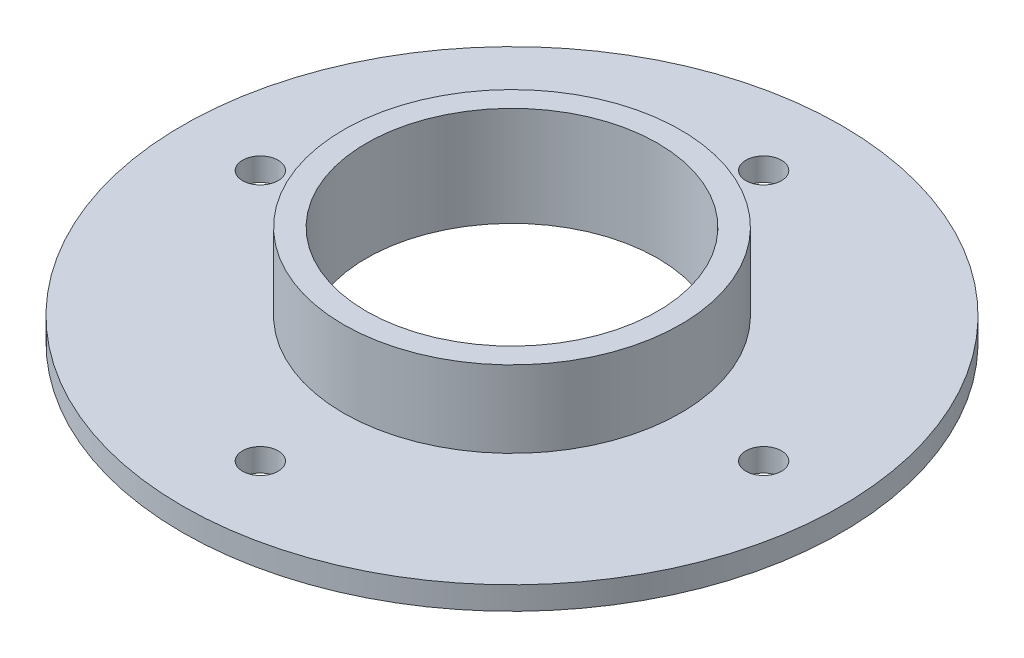
ISO-10303-21;
HEADER;
FILE_DESCRIPTION(('STEP AP214'),'2;1');
FILE_NAME('part.step','',(''),(''),'','','');
FILE_SCHEMA(('AUTOMOTIVE_DESIGN { 1 0 10303 214 1 1 1 1 }'));
ENDSEC;
DATA;
#1=APPLICATION_CONTEXT('core data for automotive mechanical design processes');
#2=APPLICATION_PROTOCOL_DEFINITION('international standard','automotive_design',2000,#1);
#3=PRODUCT_CONTEXT('',#1,'mechanical');
#4=PRODUCT('Part','Part','',(#3));
#5=PRODUCT_RELATED_PRODUCT_CATEGORY('part','',(#4));
#6=PRODUCT_DEFINITION_FORMATION('','',#4);
#7=PRODUCT_DEFINITION_CONTEXT('part definition',#1,'design');
#8=PRODUCT_DEFINITION('design','',#6,#7);
#9=PRODUCT_DEFINITION_SHAPE('','',#8);
#10=(LENGTH_UNIT() NAMED_UNIT(*) SI_UNIT(.MILLI.,.METRE.));
#11=(NAMED_UNIT(*) PLANE_ANGLE_UNIT() SI_UNIT($,.RADIAN.));
#12=(NAMED_UNIT(*) SI_UNIT($,.STERADIAN.) SOLID_ANGLE_UNIT());
#13=UNCERTAINTY_MEASURE_WITH_UNIT(LENGTH_MEASURE(1.E-05),#10,'distance_accuracy_value','');
#14=(GEOMETRIC_REPRESENTATION_CONTEXT(3) GLOBAL_UNCERTAINTY_ASSIGNED_CONTEXT((#13)) GLOBAL_UNIT_ASSIGNED_CONTEXT((#10,
#11,#12)) REPRESENTATION_CONTEXT('',''));
#15=CARTESIAN_POINT('',(0.,0.,0.));
#16=DIRECTION('',(0.,0.,1.));
#17=DIRECTION('',(1.,0.,0.));
#18=AXIS2_PLACEMENT_3D('',#15,#16,#17);
#19=CARTESIAN_POINT('',(0.,3.,0.));
#20=DIRECTION('',(0.,-1.,0.));
#21=DIRECTION('',(0.,0.,-1.));
#22=AXIS2_PLACEMENT_3D('',#19,#20,#21);
#23=CYLINDRICAL_SURFACE('',#22,43.);
#24=CARTESIAN_POINT('',(0.,3.,0.));
#25=DIRECTION('',(0.,1.,0.));
#26=DIRECTION('',(0.,0.,1.));
#27=AXIS2_PLACEMENT_3D('',#24,#25,#26);
#28=CIRCLE('',#27,43.);
#29=CARTESIAN_POINT('',(0.,3.,43.));
#30=VERTEX_POINT('',#29);
#31=EDGE_CURVE('E10',#30,#30,#28,.T.);
#32=ORIENTED_EDGE('',*,*,#31,.F.);
#33=EDGE_LOOP('',(#32));
#34=FACE_BOUND('',#33,.T.);
#35=CARTESIAN_POINT('',(0.,0.,0.));
#36=DIRECTION('',(0.,1.,0.));
#37=DIRECTION('',(0.,0.,1.));
#38=AXIS2_PLACEMENT_3D('',#35,#36,#37);
#39=CIRCLE('',#38,43.);
#40=CARTESIAN_POINT('',(0.,0.,43.));
#41=VERTEX_POINT('',#40);
#42=EDGE_CURVE('E45',#41,#41,#39,.T.);
#43=ORIENTED_EDGE('',*,*,#42,.T.);
#44=EDGE_LOOP('',(#43));
#45=FACE_BOUND('',#44,.T.);
#46=ADVANCED_FACE('F37',(#34,#45),#23,.T.);
#47=CARTESIAN_POINT('',(0.,3.,0.));
#48=DIRECTION('',(0.,1.,0.));
#49=DIRECTION('',(0.,0.,1.));
#50=AXIS2_PLACEMENT_3D('',#47,#48,#49);
#51=PLANE('',#50);
#52=CARTESIAN_POINT('',(0.,3.,-32.8376892049423));
#53=DIRECTION('',(0.,1.,0.));
#54=DIRECTION('',(0.,0.,1.));
#55=AXIS2_PLACEMENT_3D('',#52,#53,#54);
#56=CIRCLE('',#55,2.32018909355612);
#57=CARTESIAN_POINT('',(0.,3.,-30.5175001113861));
#58=VERTEX_POINT('',#57);
#59=EDGE_CURVE('E62',#58,#58,#56,.T.);
#60=ORIENTED_EDGE('',*,*,#59,.F.);
#61=EDGE_LOOP('',(#60));
#62=FACE_BOUND('',#61,.T.);
#63=CARTESIAN_POINT('',(32.8376892049432,3.,-9.27271075302349E-13));
#64=DIRECTION('',(0.,1.,0.));
#65=DIRECTION('',(0.,0.,1.));
#66=AXIS2_PLACEMENT_3D('',#63,#64,#65);
#67=CIRCLE('',#66,2.32018909355684);
#68=CARTESIAN_POINT('',(32.8376892049432,3.,2.32018909355591));
#69=VERTEX_POINT('',#68);
#70=EDGE_CURVE('E87',#69,#69,#67,.T.);
#71=ORIENTED_EDGE('',*,*,#70,.F.);
#72=EDGE_LOOP('',(#71));
#73=FACE_BOUND('',#72,.T.);
#74=CARTESIAN_POINT('',(1.8545421506047E-12,3.,32.8376892049423));
#75=DIRECTION('',(0.,1.,0.));
#76=DIRECTION('',(0.,0.,1.));
#77=AXIS2_PLACEMENT_3D('',#74,#75,#76);
#78=CIRCLE('',#77,2.32018909355811);
#79=CARTESIAN_POINT('',(1.8545421506047E-12,3.,35.1578782985004));
#80=VERTEX_POINT('',#79);
#81=EDGE_CURVE('E140',#80,#80,#78,.T.);
#82=ORIENTED_EDGE('',*,*,#81,.F.);
#83=EDGE_LOOP('',(#82));
#84=FACE_BOUND('',#83,.T.);
#85=CARTESIAN_POINT('',(-32.8376892049413,3.,9.31292532399972E-13));
#86=DIRECTION('',(0.,1.,0.));
#87=DIRECTION('',(0.,0.,1.));
#88=AXIS2_PLACEMENT_3D('',#85,#86,#87);
#89=CIRCLE('',#88,2.32018909355761);
#90=CARTESIAN_POINT('',(-32.8376892049413,3.,2.32018909355854));
#91=VERTEX_POINT('',#90);
#92=EDGE_CURVE('E154',#91,#91,#89,.T.);
#93=ORIENTED_EDGE('',*,*,#92,.F.);
#94=EDGE_LOOP('',(#93));
#95=FACE_BOUND('',#94,.T.);
#96=CARTESIAN_POINT('',(0.,3.,0.));
#97=DIRECTION('',(0.,1.,0.));
#98=DIRECTION('',(0.,0.,1.));
#99=AXIS2_PLACEMENT_3D('',#96,#97,#98);
#100=CIRCLE('',#99,22.);
#101=CARTESIAN_POINT('',(0.,3.,22.));
#102=VERTEX_POINT('',#101);
#103=EDGE_CURVE('E54',#102,#102,#100,.T.);
#104=ORIENTED_EDGE('',*,*,#103,.F.);
#105=EDGE_LOOP('',(#104));
#106=FACE_BOUND('',#105,.T.);
#107=ORIENTED_EDGE('',*,*,#31,.T.);
#108=EDGE_LOOP('',(#107));
#109=FACE_BOUND('',#108,.T.);
#110=ADVANCED_FACE('F103',(#62,#73,#84,#95,#106,#109),#51,.T.);
#111=CARTESIAN_POINT('',(0.,0.,0.));
#112=DIRECTION('',(0.,1.,0.));
#113=DIRECTION('',(0.,0.,1.));
#114=AXIS2_PLACEMENT_3D('',#111,#112,#113);
#115=PLANE('',#114);
#116=CARTESIAN_POINT('',(0.,0.,-32.8376892049423));
#117=DIRECTION('',(0.,1.,0.));
#118=DIRECTION('',(0.,0.,1.));
#119=AXIS2_PLACEMENT_3D('',#116,#117,#118);
#120=CIRCLE('',#119,2.32018909355612);
#121=CARTESIAN_POINT('',(0.,0.,-30.5175001113861));
#122=VERTEX_POINT('',#121);
#123=EDGE_CURVE('E40',#122,#122,#120,.T.);
#124=ORIENTED_EDGE('',*,*,#123,.T.);
#125=EDGE_LOOP('',(#124));
#126=FACE_BOUND('',#125,.T.);
#127=CARTESIAN_POINT('',(32.8376892049432,0.,-9.27271075302349E-13));
#128=DIRECTION('',(0.,1.,0.));
#129=DIRECTION('',(0.,0.,1.));
#130=AXIS2_PLACEMENT_3D('',#127,#128,#129);
#131=CIRCLE('',#130,2.32018909355684);
#132=CARTESIAN_POINT('',(32.8376892049432,0.,2.32018909355591));
#133=VERTEX_POINT('',#132);
#134=EDGE_CURVE('E69',#133,#133,#131,.T.);
#135=ORIENTED_EDGE('',*,*,#134,.T.);
#136=EDGE_LOOP('',(#135));
#137=FACE_BOUND('',#136,.T.);
#138=CARTESIAN_POINT('',(1.8545421506047E-12,0.,32.8376892049423));
#139=DIRECTION('',(0.,1.,0.));
#140=DIRECTION('',(0.,0.,1.));
#141=AXIS2_PLACEMENT_3D('',#138,#139,#140);
#142=CIRCLE('',#141,2.32018909355811);
#143=CARTESIAN_POINT('',(1.8545421506047E-12,0.,35.1578782985004));
#144=VERTEX_POINT('',#143);
#145=EDGE_CURVE('E66',#144,#144,#142,.T.);
#146=ORIENTED_EDGE('',*,*,#145,.T.);
#147=EDGE_LOOP('',(#146));
#148=FACE_BOUND('',#147,.T.);
#149=CARTESIAN_POINT('',(-32.8376892049413,0.,9.31292532399972E-13));
#150=DIRECTION('',(0.,1.,0.));
#151=DIRECTION('',(0.,0.,1.));
#152=AXIS2_PLACEMENT_3D('',#149,#150,#151);
#153=CIRCLE('',#152,2.32018909355761);
#154=CARTESIAN_POINT('',(-32.8376892049413,0.,2.32018909355854));
#155=VERTEX_POINT('',#154);
#156=EDGE_CURVE('E61',#155,#155,#153,.T.);
#157=ORIENTED_EDGE('',*,*,#156,.T.);
#158=EDGE_LOOP('',(#157));
#159=FACE_BOUND('',#158,.T.);
#160=CARTESIAN_POINT('',(0.,0.,0.));
#161=DIRECTION('',(0.,1.,0.));
#162=DIRECTION('',(0.,0.,1.));
#163=AXIS2_PLACEMENT_3D('',#160,#161,#162);
#164=CIRCLE('',#163,19.);
#165=CARTESIAN_POINT('',(0.,0.,19.));
#166=VERTEX_POINT('',#165);
#167=EDGE_CURVE('E57',#166,#166,#164,.T.);
#168=ORIENTED_EDGE('',*,*,#167,.T.);
#169=EDGE_LOOP('',(#168));
#170=FACE_BOUND('',#169,.T.);
#171=ORIENTED_EDGE('',*,*,#42,.F.);
#172=EDGE_LOOP('',(#171));
#173=FACE_BOUND('',#172,.T.);
#174=ADVANCED_FACE('F105',(#126,#137,#148,#159,#170,#173),#115,.F.);
#175=CARTESIAN_POINT('',(0.,13.,0.));
#176=DIRECTION('',(0.,1.,0.));
#177=DIRECTION('',(0.,0.,1.));
#178=AXIS2_PLACEMENT_3D('',#175,#176,#177);
#179=PLANE('',#178);
#180=CARTESIAN_POINT('',(0.,13.,0.));
#181=DIRECTION('',(0.,1.,0.));
#182=DIRECTION('',(0.,0.,1.));
#183=AXIS2_PLACEMENT_3D('',#180,#181,#182);
#184=CIRCLE('',#183,22.);
#185=CARTESIAN_POINT('',(0.,13.,22.));
#186=VERTEX_POINT('',#185);
#187=EDGE_CURVE('E51',#186,#186,#184,.T.);
#188=ORIENTED_EDGE('',*,*,#187,.T.);
#189=EDGE_LOOP('',(#188));
#190=FACE_BOUND('',#189,.T.);
#191=CARTESIAN_POINT('',(0.,13.,0.));
#192=DIRECTION('',(0.,1.,0.));
#193=DIRECTION('',(0.,0.,1.));
#194=AXIS2_PLACEMENT_3D('',#191,#192,#193);
#195=CIRCLE('',#194,19.);
#196=CARTESIAN_POINT('',(0.,13.,19.));
#197=VERTEX_POINT('',#196);
#198=EDGE_CURVE('E76',#197,#197,#195,.T.);
#199=ORIENTED_EDGE('',*,*,#198,.F.);
#200=EDGE_LOOP('',(#199));
#201=FACE_BOUND('',#200,.T.);
#202=ADVANCED_FACE('F93',(#190,#201),#179,.T.);
#203=CARTESIAN_POINT('',(0.,13.,0.));
#204=DIRECTION('',(0.,-1.,0.));
#205=DIRECTION('',(0.,0.,-1.));
#206=AXIS2_PLACEMENT_3D('',#203,#204,#205);
#207=CYLINDRICAL_SURFACE('',#206,22.);
#208=ORIENTED_EDGE('',*,*,#187,.F.);
#209=EDGE_LOOP('',(#208));
#210=FACE_BOUND('',#209,.T.);
#211=ORIENTED_EDGE('',*,*,#103,.T.);
#212=EDGE_LOOP('',(#211));
#213=FACE_BOUND('',#212,.T.);
#214=ADVANCED_FACE('F96',(#210,#213),#207,.T.);
#215=CARTESIAN_POINT('',(0.,13.,0.));
#216=DIRECTION('',(0.,-1.,0.));
#217=DIRECTION('',(0.,0.,-1.));
#218=AXIS2_PLACEMENT_3D('',#215,#216,#217);
#219=CYLINDRICAL_SURFACE('',#218,19.);
#220=ORIENTED_EDGE('',*,*,#198,.T.);
#221=EDGE_LOOP('',(#220));
#222=FACE_BOUND('',#221,.T.);
#223=ORIENTED_EDGE('',*,*,#167,.F.);
#224=EDGE_LOOP('',(#223));
#225=FACE_BOUND('',#224,.T.);
#226=ADVANCED_FACE('F99',(#222,#225),#219,.F.);
#227=CARTESIAN_POINT('',(-32.8376892049413,-17.,9.31292532399972E-13));
#228=DIRECTION('',(0.,1.,0.));
#229=DIRECTION('',(0.,0.,1.));
#230=AXIS2_PLACEMENT_3D('',#227,#228,#229);
#231=CYLINDRICAL_SURFACE('',#230,2.32018909355761);
#232=ORIENTED_EDGE('',*,*,#92,.T.);
#233=EDGE_LOOP('',(#232));
#234=FACE_BOUND('',#233,.T.);
#235=ORIENTED_EDGE('',*,*,#156,.F.);
#236=EDGE_LOOP('',(#235));
#237=FACE_BOUND('',#236,.T.);
#238=ADVANCED_FACE('F120',(#234,#237),#231,.F.);
#239=CARTESIAN_POINT('',(1.8545421506047E-12,-17.,32.8376892049423));
#240=DIRECTION('',(0.,1.,0.));
#241=DIRECTION('',(0.,0.,1.));
#242=AXIS2_PLACEMENT_3D('',#239,#240,#241);
#243=CYLINDRICAL_SURFACE('',#242,2.32018909355811);
#244=ORIENTED_EDGE('',*,*,#81,.T.);
#245=EDGE_LOOP('',(#244));
#246=FACE_BOUND('',#245,.T.);
#247=ORIENTED_EDGE('',*,*,#145,.F.);
#248=EDGE_LOOP('',(#247));
#249=FACE_BOUND('',#248,.T.);
#250=ADVANCED_FACE('F125',(#246,#249),#243,.F.);
#251=CARTESIAN_POINT('',(32.8376892049432,-17.,-9.27271075302349E-13));
#252=DIRECTION('',(0.,1.,0.));
#253=DIRECTION('',(0.,0.,1.));
#254=AXIS2_PLACEMENT_3D('',#251,#252,#253);
#255=CYLINDRICAL_SURFACE('',#254,2.32018909355684);
#256=ORIENTED_EDGE('',*,*,#70,.T.);
#257=EDGE_LOOP('',(#256));
#258=FACE_BOUND('',#257,.T.);
#259=ORIENTED_EDGE('',*,*,#134,.F.);
#260=EDGE_LOOP('',(#259));
#261=FACE_BOUND('',#260,.T.);
#262=ADVANCED_FACE('F121',(#258,#261),#255,.F.);
#263=CARTESIAN_POINT('',(0.,-17.,-32.8376892049423));
#264=DIRECTION('',(0.,1.,0.));
#265=DIRECTION('',(0.,0.,1.));
#266=AXIS2_PLACEMENT_3D('',#263,#264,#265);
#267=CYLINDRICAL_SURFACE('',#266,2.32018909355612);
#268=ORIENTED_EDGE('',*,*,#59,.T.);
#269=EDGE_LOOP('',(#268));
#270=FACE_BOUND('',#269,.T.);
#271=ORIENTED_EDGE('',*,*,#123,.F.);
#272=EDGE_LOOP('',(#271));
#273=FACE_BOUND('',#272,.T.);
#274=ADVANCED_FACE('F124',(#270,#273),#267,.F.);
#275=CLOSED_SHELL('',(#46,#110,#174,#202,#214,#226,#238,#250,#262,#274));
#276=MANIFOLD_SOLID_BREP('B2',#275);
#277=ADVANCED_BREP_SHAPE_REPRESENTATION('',(#18,#276),#14);
#278=SHAPE_DEFINITION_REPRESENTATION(#9,#277);
ENDSEC;
END-ISO-10303-21;
